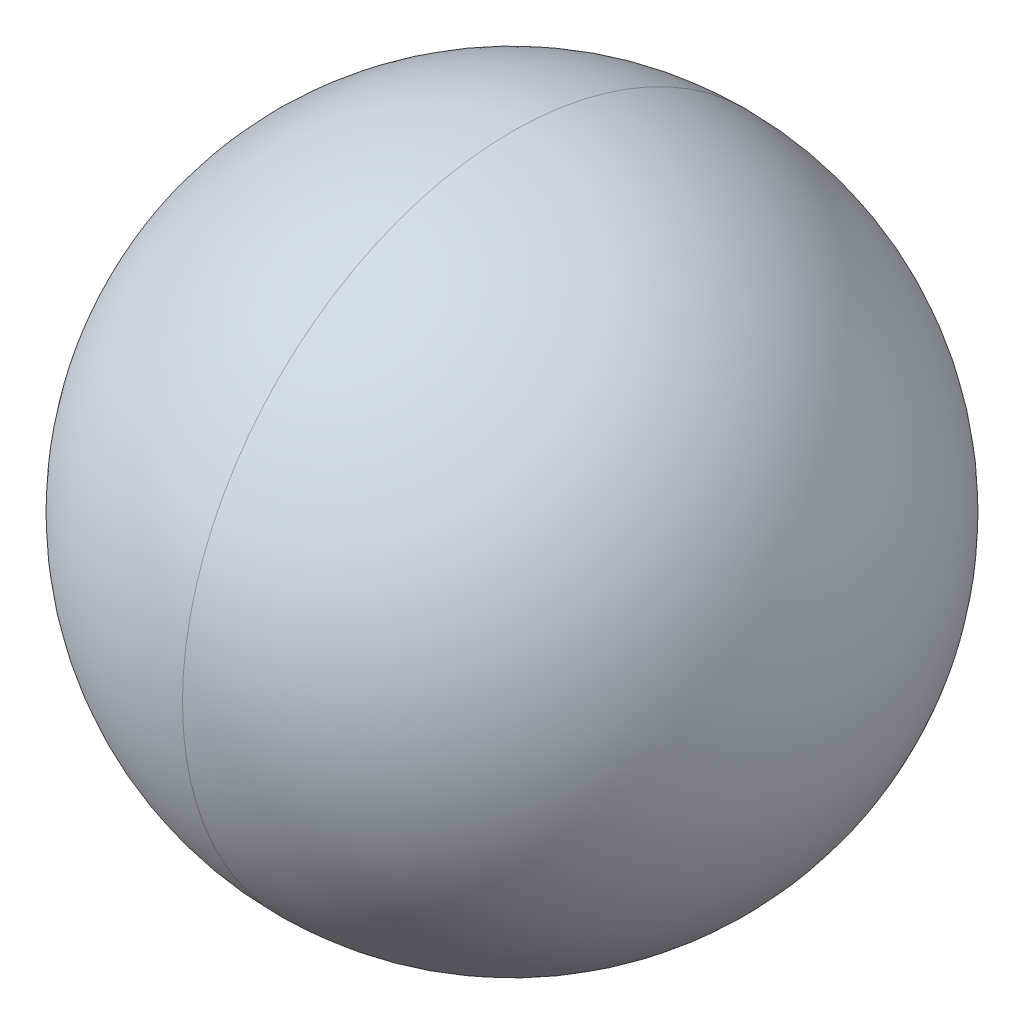
ISO-10303-21;
HEADER;
FILE_DESCRIPTION(('STEP AP214'),'2;1');
FILE_NAME('part.step','',(''),(''),'','','');
FILE_SCHEMA(('AUTOMOTIVE_DESIGN { 1 0 10303 214 1 1 1 1 }'));
ENDSEC;
DATA;
#1=APPLICATION_CONTEXT('core data for automotive mechanical design processes');
#2=APPLICATION_PROTOCOL_DEFINITION('international standard','automotive_design',2000,#1);
#3=PRODUCT_CONTEXT('',#1,'mechanical');
#4=PRODUCT('Part','Part','',(#3));
#5=PRODUCT_RELATED_PRODUCT_CATEGORY('part','',(#4));
#6=PRODUCT_DEFINITION_FORMATION('','',#4);
#7=PRODUCT_DEFINITION_CONTEXT('part definition',#1,'design');
#8=PRODUCT_DEFINITION('design','',#6,#7);
#9=PRODUCT_DEFINITION_SHAPE('','',#8);
#10=(LENGTH_UNIT() NAMED_UNIT(*) SI_UNIT(.MILLI.,.METRE.));
#11=(NAMED_UNIT(*) PLANE_ANGLE_UNIT() SI_UNIT($,.RADIAN.));
#12=(NAMED_UNIT(*) SI_UNIT($,.STERADIAN.) SOLID_ANGLE_UNIT());
#13=UNCERTAINTY_MEASURE_WITH_UNIT(LENGTH_MEASURE(1.E-05),#10,'distance_accuracy_value','');
#14=(GEOMETRIC_REPRESENTATION_CONTEXT(3) GLOBAL_UNCERTAINTY_ASSIGNED_CONTEXT((#13)) GLOBAL_UNIT_ASSIGNED_CONTEXT((#10,
#11,#12)) REPRESENTATION_CONTEXT('',''));
#15=CARTESIAN_POINT('',(0.,0.,0.));
#16=DIRECTION('',(0.,0.,1.));
#17=DIRECTION('',(1.,0.,0.));
#18=AXIS2_PLACEMENT_3D('',#15,#16,#17);
#19=CARTESIAN_POINT('',(0.175,-0.175,-0.01));
#20=DIRECTION('',(1.,0.,0.));
#21=DIRECTION('',(0.,1.,0.));
#22=AXIS2_PLACEMENT_3D('',#19,#20,#21);
#23=SPHERICAL_SURFACE('',#22,0.09);
#24=CARTESIAN_POINT('',(0.175,-0.175,-0.01));
#25=DIRECTION('',(-1.,0.,0.));
#26=DIRECTION('',(0.,0.,1.));
#27=AXIS2_PLACEMENT_3D('',#24,#25,#26);
#28=CIRCLE('',#27,0.09);
#29=CARTESIAN_POINT('',(0.175,-0.085,-0.01));
#30=VERTEX_POINT('',#29);
#31=CARTESIAN_POINT('',(0.175,-0.175,-0.1));
#32=VERTEX_POINT('',#31);
#33=EDGE_CURVE('E11',#30,#32,#28,.T.);
#34=ORIENTED_EDGE('',*,*,#33,.F.);
#35=CARTESIAN_POINT('',(0.175,-0.085,-0.01));
#36=CARTESIAN_POINT('',(0.203274333882308,-0.0849999999999998,-0.00999999999999997));
#37=CARTESIAN_POINT('',(0.231575047902662,-0.0960713503641165,-0.01));
#38=CARTESIAN_POINT('',(0.253928649635883,-0.118424952097339,-0.00999999999999997));
#39=CARTESIAN_POINT('',(0.265,-0.146725666117692,-0.01));
#40=CARTESIAN_POINT('',(0.265,-0.175,-0.01));
#41=B_SPLINE_CURVE_WITH_KNOTS('',5,(#35,#36,#37,#38,#39,#40),.UNSPECIFIED.,.F.,.F.,(6,6),(0.,
1.5707963267949),.UNSPECIFIED.);
#42=CARTESIAN_POINT('',(0.265,-0.175,-0.01));
#43=VERTEX_POINT('',#42);
#44=EDGE_CURVE('E24',#30,#43,#41,.T.);
#45=ORIENTED_EDGE('',*,*,#44,.T.);
#46=ORIENTED_EDGE('',*,*,#44,.F.);
#47=CARTESIAN_POINT('',(0.175,-0.175,0.08));
#48=VERTEX_POINT('',#47);
#49=EDGE_CURVE('E25',#48,#30,#28,.T.);
#50=ORIENTED_EDGE('',*,*,#49,.F.);
#51=CARTESIAN_POINT('',(0.175,-0.175,-0.01));
#52=DIRECTION('',(1.,0.,0.));
#53=DIRECTION('',(0.,1.,0.));
#54=AXIS2_PLACEMENT_3D('',#51,#52,#53);
#55=CIRCLE('',#54,0.09);
#56=EDGE_CURVE('E46',#48,#32,#55,.T.);
#57=ORIENTED_EDGE('',*,*,#56,.T.);
#58=EDGE_LOOP('',(#34,#45,#46,#50,#57));
#59=FACE_BOUND('',#58,.T.);
#60=ADVANCED_FACE('F17',(#59),#23,.T.);
#61=CARTESIAN_POINT('',(0.175,-0.175,-0.01));
#62=DIRECTION('',(1.,0.,0.));
#63=DIRECTION('',(0.,1.,0.));
#64=AXIS2_PLACEMENT_3D('',#61,#62,#63);
#65=SPHERICAL_SURFACE('',#64,0.09);
#66=ORIENTED_EDGE('',*,*,#56,.F.);
#67=ORIENTED_EDGE('',*,*,#49,.T.);
#68=CARTESIAN_POINT('',(0.085,-0.175,-0.01));
#69=CARTESIAN_POINT('',(0.0849999999999998,-0.146725666117692,-0.00999999999999998));
#70=CARTESIAN_POINT('',(0.0960713503641165,-0.118424952097339,-0.0100000000000001));
#71=CARTESIAN_POINT('',(0.118424952097339,-0.096071350364116,-0.00999999999999999));
#72=CARTESIAN_POINT('',(0.146725666117692,-0.0850000000000001,-0.01));
#73=CARTESIAN_POINT('',(0.175,-0.085,-0.01));
#74=B_SPLINE_CURVE_WITH_KNOTS('',5,(#68,#69,#70,#71,#72,#73),.UNSPECIFIED.,.F.,.F.,(6,6),
(-1.5707963267949,0.),.UNSPECIFIED.);
#75=CARTESIAN_POINT('',(0.085,-0.175,-0.01));
#76=VERTEX_POINT('',#75);
#77=EDGE_CURVE('E44',#76,#30,#74,.T.);
#78=ORIENTED_EDGE('',*,*,#77,.F.);
#79=ORIENTED_EDGE('',*,*,#77,.T.);
#80=ORIENTED_EDGE('',*,*,#33,.T.);
#81=EDGE_LOOP('',(#66,#67,#78,#79,#80));
#82=FACE_BOUND('',#81,.T.);
#83=ADVANCED_FACE('F45',(#82),#65,.T.);
#84=CLOSED_SHELL('',(#60,#83));
#85=MANIFOLD_SOLID_BREP('B1',#84);
#86=ADVANCED_BREP_SHAPE_REPRESENTATION('',(#18,#85),#14);
#87=SHAPE_DEFINITION_REPRESENTATION(#9,#86);
ENDSEC;
END-ISO-10303-21;
